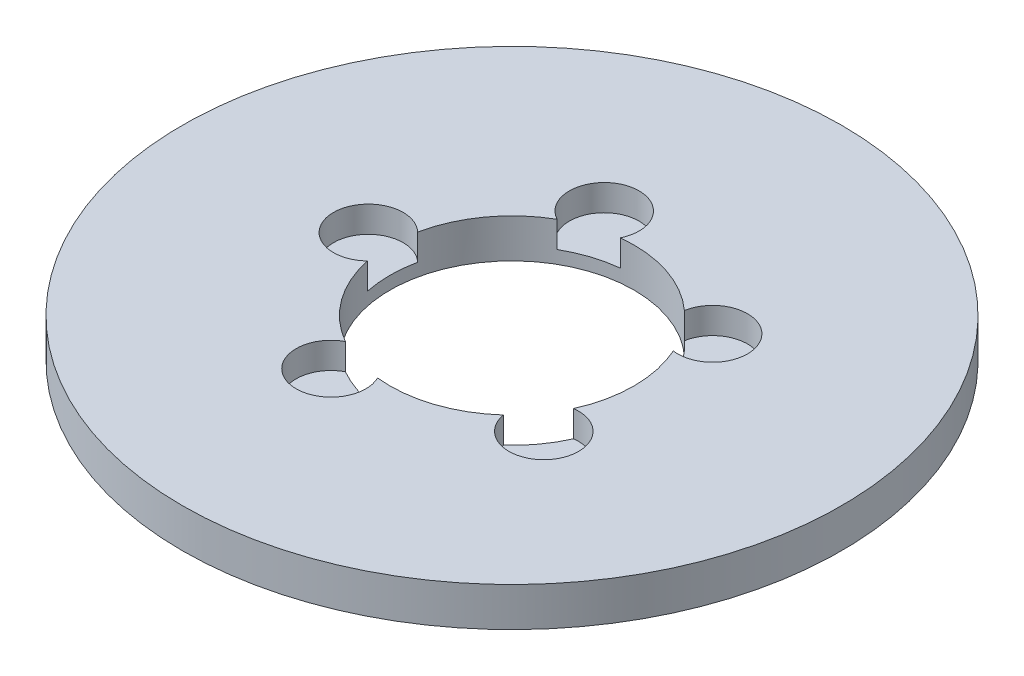
ISO-10303-21;
HEADER;
FILE_DESCRIPTION(('STEP AP214'),'2;1');
FILE_NAME('part.step','',(''),(''),'','','');
FILE_SCHEMA(('AUTOMOTIVE_DESIGN { 1 0 10303 214 1 1 1 1 }'));
ENDSEC;
DATA;
#1=APPLICATION_CONTEXT('core data for automotive mechanical design processes');
#2=APPLICATION_PROTOCOL_DEFINITION('international standard','automotive_design',2000,#1);
#3=PRODUCT_CONTEXT('',#1,'mechanical');
#4=PRODUCT('Part','Part','',(#3));
#5=PRODUCT_RELATED_PRODUCT_CATEGORY('part','',(#4));
#6=PRODUCT_DEFINITION_FORMATION('','',#4);
#7=PRODUCT_DEFINITION_CONTEXT('part definition',#1,'design');
#8=PRODUCT_DEFINITION('design','',#6,#7);
#9=PRODUCT_DEFINITION_SHAPE('','',#8);
#10=(LENGTH_UNIT() NAMED_UNIT(*) SI_UNIT(.MILLI.,.METRE.));
#11=(NAMED_UNIT(*) PLANE_ANGLE_UNIT() SI_UNIT($,.RADIAN.));
#12=(NAMED_UNIT(*) SI_UNIT($,.STERADIAN.) SOLID_ANGLE_UNIT());
#13=UNCERTAINTY_MEASURE_WITH_UNIT(LENGTH_MEASURE(1.E-05),#10,'distance_accuracy_value','');
#14=(GEOMETRIC_REPRESENTATION_CONTEXT(3) GLOBAL_UNCERTAINTY_ASSIGNED_CONTEXT((#13)) GLOBAL_UNIT_ASSIGNED_CONTEXT((#10,
#11,#12)) REPRESENTATION_CONTEXT('',''));
#15=CARTESIAN_POINT('',(0.,0.,0.));
#16=DIRECTION('',(0.,0.,1.));
#17=DIRECTION('',(1.,0.,0.));
#18=AXIS2_PLACEMENT_3D('',#15,#16,#17);
#19=CARTESIAN_POINT('',(0.,8.,0.));
#20=DIRECTION('',(0.,-1.,0.));
#21=DIRECTION('',(0.,0.,-1.));
#22=AXIS2_PLACEMENT_3D('',#19,#20,#21);
#23=CYLINDRICAL_SURFACE('',#22,67.5);
#24=CARTESIAN_POINT('',(0.,8.,0.));
#25=DIRECTION('',(0.,1.,0.));
#26=DIRECTION('',(0.,0.,1.));
#27=AXIS2_PLACEMENT_3D('',#24,#25,#26);
#28=CIRCLE('',#27,67.5);
#29=CARTESIAN_POINT('',(0.,8.,67.5));
#30=VERTEX_POINT('',#29);
#31=EDGE_CURVE('E157',#30,#30,#28,.T.);
#32=ORIENTED_EDGE('',*,*,#31,.F.);
#33=EDGE_LOOP('',(#32));
#34=FACE_BOUND('',#33,.T.);
#35=CARTESIAN_POINT('',(0.,0.,0.));
#36=DIRECTION('',(0.,1.,0.));
#37=DIRECTION('',(0.,0.,1.));
#38=AXIS2_PLACEMENT_3D('',#35,#36,#37);
#39=CIRCLE('',#38,67.5);
#40=CARTESIAN_POINT('',(0.,0.,67.5));
#41=VERTEX_POINT('',#40);
#42=EDGE_CURVE('E150',#41,#41,#39,.T.);
#43=ORIENTED_EDGE('',*,*,#42,.T.);
#44=EDGE_LOOP('',(#43));
#45=FACE_BOUND('',#44,.T.);
#46=ADVANCED_FACE('F39',(#34,#45),#23,.T.);
#47=CARTESIAN_POINT('',(0.,8.,0.));
#48=DIRECTION('',(0.,1.,0.));
#49=DIRECTION('',(0.,0.,1.));
#50=AXIS2_PLACEMENT_3D('',#47,#48,#49);
#51=PLANE('',#50);
#52=CARTESIAN_POINT('',(-9.09192710031537,8.,-27.9820743578371));
#53=DIRECTION('',(0.,1.,0.));
#54=DIRECTION('',(-0.95105651629515,0.,0.309016994374958));
#55=AXIS2_PLACEMENT_3D('',#52,#53,#54);
#56=CIRCLE('',#55,7.13841758908259);
#57=CARTESIAN_POINT('',(-2.6741215231742,8.,-24.8565700385089));
#58=VERTEX_POINT('',#57);
#59=CARTESIAN_POINT('',(-12.4469155339392,8.,-21.6811967771842));
#60=VERTEX_POINT('',#59);
#61=EDGE_CURVE('E194',#58,#60,#56,.T.);
#62=ORIENTED_EDGE('',*,*,#61,.F.);
#63=CARTESIAN_POINT('',(0.,8.,0.));
#64=DIRECTION('',(0.,1.,0.));
#65=DIRECTION('',(0.,0.,1.));
#66=AXIS2_PLACEMENT_3D('',#63,#64,#65);
#67=CIRCLE('',#66,25.);
#68=CARTESIAN_POINT('',(16.7737350484818,8.,-18.5375783888655));
#69=VERTEX_POINT('',#68);
#70=EDGE_CURVE('E147',#69,#58,#67,.T.);
#71=ORIENTED_EDGE('',*,*,#70,.F.);
#72=CARTESIAN_POINT('',(23.8029741718609,8.,-17.2938730288705));
#73=DIRECTION('',(0.,1.,0.));
#74=DIRECTION('',(-0.58778525229248,0.,-0.809016994374942));
#75=AXIS2_PLACEMENT_3D('',#72,#73,#74);
#76=CIRCLE('',#75,7.13841758908259);
#77=CARTESIAN_POINT('',(22.8136539121861,8.,-10.2243432637503));
#78=VERTEX_POINT('',#77);
#79=EDGE_CURVE('E254',#78,#69,#76,.T.);
#80=ORIENTED_EDGE('',*,*,#79,.F.);
#81=CARTESIAN_POINT('',(22.8136539121863,8.,10.2243432637499));
#82=VERTEX_POINT('',#81);
#83=EDGE_CURVE('E144',#82,#78,#67,.T.);
#84=ORIENTED_EDGE('',*,*,#83,.F.);
#85=CARTESIAN_POINT('',(23.8029741718612,8.,17.2938730288701));
#86=DIRECTION('',(0.,1.,0.));
#87=DIRECTION('',(0.587785252292469,0.,-0.809016994374951));
#88=AXIS2_PLACEMENT_3D('',#85,#86,#87);
#89=CIRCLE('',#88,7.13841758908259);
#90=CARTESIAN_POINT('',(16.7737350484821,8.,18.5375783888652));
#91=VERTEX_POINT('',#90);
#92=EDGE_CURVE('E141',#91,#82,#89,.T.);
#93=ORIENTED_EDGE('',*,*,#92,.F.);
#94=CARTESIAN_POINT('',(-2.67412152317385,8.,24.8565700385089));
#95=VERTEX_POINT('',#94);
#96=EDGE_CURVE('E134',#95,#91,#67,.T.);
#97=ORIENTED_EDGE('',*,*,#96,.F.);
#98=CARTESIAN_POINT('',(-9.09192710031498,8.,27.9820743578372));
#99=DIRECTION('',(0.,1.,0.));
#100=DIRECTION('',(0.951056516295155,0.,0.309016994374945));
#101=AXIS2_PLACEMENT_3D('',#98,#99,#100);
#102=CIRCLE('',#101,7.13841758908259);
#103=CARTESIAN_POINT('',(-12.4469155339389,8.,21.6811967771844));
#104=VERTEX_POINT('',#103);
#105=EDGE_CURVE('E111',#104,#95,#102,.T.);
#106=ORIENTED_EDGE('',*,*,#105,.F.);
#107=CARTESIAN_POINT('',(-24.4663519035553,8.,5.13786186379071));
#108=VERTEX_POINT('',#107);
#109=EDGE_CURVE('E145',#108,#104,#67,.T.);
#110=ORIENTED_EDGE('',*,*,#109,.F.);
#111=CARTESIAN_POINT('',(-29.4220941430921,8.,0.));
#112=DIRECTION('',(0.,1.,0.));
#113=DIRECTION('',(0.,0.,1.));
#114=AXIS2_PLACEMENT_3D('',#111,#112,#113);
#115=CIRCLE('',#114,7.13841758908259);
#116=CARTESIAN_POINT('',(-24.4663519035553,8.,-5.13786186379071));
#117=VERTEX_POINT('',#116);
#118=EDGE_CURVE('E153',#117,#108,#115,.T.);
#119=ORIENTED_EDGE('',*,*,#118,.F.);
#120=EDGE_CURVE('E146',#60,#117,#67,.T.);
#121=ORIENTED_EDGE('',*,*,#120,.F.);
#122=EDGE_LOOP('',(#62,#71,#80,#84,#93,#97,#106,#110,#119,#121));
#123=FACE_BOUND('',#122,.T.);
#124=ORIENTED_EDGE('',*,*,#31,.T.);
#125=EDGE_LOOP('',(#124));
#126=FACE_BOUND('',#125,.T.);
#127=ADVANCED_FACE('F139',(#123,#126),#51,.T.);
#128=CARTESIAN_POINT('',(0.,0.,0.));
#129=DIRECTION('',(0.,1.,0.));
#130=DIRECTION('',(0.,0.,1.));
#131=AXIS2_PLACEMENT_3D('',#128,#129,#130);
#132=PLANE('',#131);
#133=CARTESIAN_POINT('',(0.,0.,0.));
#134=DIRECTION('',(0.,1.,0.));
#135=DIRECTION('',(0.,0.,1.));
#136=AXIS2_PLACEMENT_3D('',#133,#134,#135);
#137=CIRCLE('',#136,25.);
#138=CARTESIAN_POINT('',(0.,0.,25.));
#139=VERTEX_POINT('',#138);
#140=EDGE_CURVE('E154',#139,#139,#137,.T.);
#141=ORIENTED_EDGE('',*,*,#140,.T.);
#142=EDGE_LOOP('',(#141));
#143=FACE_BOUND('',#142,.T.);
#144=ORIENTED_EDGE('',*,*,#42,.F.);
#145=EDGE_LOOP('',(#144));
#146=FACE_BOUND('',#145,.T.);
#147=ADVANCED_FACE('F213',(#143,#146),#132,.F.);
#148=CARTESIAN_POINT('',(0.,8.,0.));
#149=DIRECTION('',(0.,-1.,0.));
#150=DIRECTION('',(0.,0.,-1.));
#151=AXIS2_PLACEMENT_3D('',#148,#149,#150);
#152=CYLINDRICAL_SURFACE('',#151,25.);
#153=DIRECTION('',(0.,1.,0.));
#154=VECTOR('',#153,1.);
#155=CARTESIAN_POINT('',(-2.67412152317419,5.31698554322973,-24.8565700385089));
#156=LINE('',#155,#154);
#157=CARTESIAN_POINT('',(-2.6741215231742,2.63397108645947,-24.8565700385089));
#158=VERTEX_POINT('',#157);
#159=EDGE_CURVE('E11',#158,#58,#156,.T.);
#160=ORIENTED_EDGE('',*,*,#159,.F.);
#161=CARTESIAN_POINT('',(0.,2.63397108645947,0.));
#162=DIRECTION('',(0.,1.,0.));
#163=DIRECTION('',(0.,0.,1.));
#164=AXIS2_PLACEMENT_3D('',#161,#162,#163);
#165=CIRCLE('',#164,25.);
#166=CARTESIAN_POINT('',(-12.4469155339392,2.63397108645947,-21.6811967771842));
#167=VERTEX_POINT('',#166);
#168=EDGE_CURVE('E189',#158,#167,#165,.T.);
#169=ORIENTED_EDGE('',*,*,#168,.T.);
#170=DIRECTION('',(0.,1.,0.));
#171=VECTOR('',#170,1.);
#172=CARTESIAN_POINT('',(-12.4469155339392,5.31698554322973,-21.6811967771842));
#173=LINE('',#172,#171);
#174=EDGE_CURVE('E46',#60,#167,#173,.F.);
#175=ORIENTED_EDGE('',*,*,#174,.F.);
#176=ORIENTED_EDGE('',*,*,#120,.T.);
#177=DIRECTION('',(0.,1.,0.));
#178=VECTOR('',#177,1.);
#179=CARTESIAN_POINT('',(-24.4663519035553,5.31698554322973,-5.13786186379072));
#180=LINE('',#179,#178);
#181=CARTESIAN_POINT('',(-24.4663519035553,2.63397108645947,-5.13786186379071));
#182=VERTEX_POINT('',#181);
#183=EDGE_CURVE('E168',#182,#117,#180,.T.);
#184=ORIENTED_EDGE('',*,*,#183,.F.);
#185=CARTESIAN_POINT('',(0.,2.63397108645947,0.));
#186=DIRECTION('',(0.,1.,0.));
#187=DIRECTION('',(0.,0.,1.));
#188=AXIS2_PLACEMENT_3D('',#185,#186,#187);
#189=CIRCLE('',#188,25.);
#190=CARTESIAN_POINT('',(-24.4663519035553,2.63397108645947,5.13786186379071));
#191=VERTEX_POINT('',#190);
#192=EDGE_CURVE('E165',#182,#191,#189,.T.);
#193=ORIENTED_EDGE('',*,*,#192,.T.);
#194=DIRECTION('',(0.,1.,0.));
#195=VECTOR('',#194,1.);
#196=CARTESIAN_POINT('',(-24.4663519035553,5.31698554322973,5.13786186379072));
#197=LINE('',#196,#195);
#198=EDGE_CURVE('E170',#108,#191,#197,.F.);
#199=ORIENTED_EDGE('',*,*,#198,.F.);
#200=ORIENTED_EDGE('',*,*,#109,.T.);
#201=DIRECTION('',(0.,1.,0.));
#202=VECTOR('',#201,1.);
#203=CARTESIAN_POINT('',(-12.4469155339389,5.31698554322973,21.6811967771844));
#204=LINE('',#203,#202);
#205=CARTESIAN_POINT('',(-12.4469155339389,2.63397108645947,21.6811967771844));
#206=VERTEX_POINT('',#205);
#207=EDGE_CURVE('E121',#206,#104,#204,.T.);
#208=ORIENTED_EDGE('',*,*,#207,.F.);
#209=CARTESIAN_POINT('',(0.,2.63397108645947,0.));
#210=DIRECTION('',(0.,1.,0.));
#211=DIRECTION('',(0.,0.,1.));
#212=AXIS2_PLACEMENT_3D('',#209,#210,#211);
#213=CIRCLE('',#212,25.);
#214=CARTESIAN_POINT('',(-2.67412152317385,2.63397108645947,24.8565700385089));
#215=VERTEX_POINT('',#214);
#216=EDGE_CURVE('E136',#206,#215,#213,.T.);
#217=ORIENTED_EDGE('',*,*,#216,.T.);
#218=DIRECTION('',(0.,1.,0.));
#219=VECTOR('',#218,1.);
#220=CARTESIAN_POINT('',(-2.67412152317384,5.31698554322973,24.8565700385089));
#221=LINE('',#220,#219);
#222=EDGE_CURVE('E117',#95,#215,#221,.F.);
#223=ORIENTED_EDGE('',*,*,#222,.F.);
#224=ORIENTED_EDGE('',*,*,#96,.T.);
#225=DIRECTION('',(0.,1.,0.));
#226=VECTOR('',#225,1.);
#227=CARTESIAN_POINT('',(16.7737350484821,5.31698554322973,18.5375783888652));
#228=LINE('',#227,#226);
#229=CARTESIAN_POINT('',(16.7737350484821,2.63397108645947,18.5375783888652));
#230=VERTEX_POINT('',#229);
#231=EDGE_CURVE('E182',#230,#91,#228,.T.);
#232=ORIENTED_EDGE('',*,*,#231,.F.);
#233=CARTESIAN_POINT('',(0.,2.63397108645947,0.));
#234=DIRECTION('',(0.,1.,0.));
#235=DIRECTION('',(0.,0.,1.));
#236=AXIS2_PLACEMENT_3D('',#233,#234,#235);
#237=CIRCLE('',#236,25.);
#238=CARTESIAN_POINT('',(22.8136539121863,2.63397108645947,10.2243432637499));
#239=VERTEX_POINT('',#238);
#240=EDGE_CURVE('E174',#230,#239,#237,.T.);
#241=ORIENTED_EDGE('',*,*,#240,.T.);
#242=DIRECTION('',(0.,1.,0.));
#243=VECTOR('',#242,1.);
#244=CARTESIAN_POINT('',(22.8136539121863,5.31698554322973,10.2243432637499));
#245=LINE('',#244,#243);
#246=EDGE_CURVE('E177',#82,#239,#245,.F.);
#247=ORIENTED_EDGE('',*,*,#246,.F.);
#248=ORIENTED_EDGE('',*,*,#83,.T.);
#249=DIRECTION('',(0.,1.,0.));
#250=VECTOR('',#249,1.);
#251=CARTESIAN_POINT('',(22.8136539121861,5.31698554322973,-10.2243432637503));
#252=LINE('',#251,#250);
#253=CARTESIAN_POINT('',(22.8136539121861,2.63397108645947,-10.2243432637503));
#254=VERTEX_POINT('',#253);
#255=EDGE_CURVE('E187',#254,#78,#252,.T.);
#256=ORIENTED_EDGE('',*,*,#255,.F.);
#257=CARTESIAN_POINT('',(0.,2.63397108645947,0.));
#258=DIRECTION('',(0.,1.,0.));
#259=DIRECTION('',(0.,0.,1.));
#260=AXIS2_PLACEMENT_3D('',#257,#258,#259);
#261=CIRCLE('',#260,25.);
#262=CARTESIAN_POINT('',(16.7737350484818,2.63397108645947,-18.5375783888655));
#263=VERTEX_POINT('',#262);
#264=EDGE_CURVE('E181',#254,#263,#261,.T.);
#265=ORIENTED_EDGE('',*,*,#264,.T.);
#266=DIRECTION('',(0.,1.,0.));
#267=VECTOR('',#266,1.);
#268=CARTESIAN_POINT('',(16.7737350484818,5.31698554322973,-18.5375783888655));
#269=LINE('',#268,#267);
#270=EDGE_CURVE('E186',#69,#263,#269,.F.);
#271=ORIENTED_EDGE('',*,*,#270,.F.);
#272=ORIENTED_EDGE('',*,*,#70,.T.);
#273=EDGE_LOOP('',(#160,#169,#175,#176,#184,#193,#199,#200,#208,#217,#223,#224,#232,#241,#247,
#248,#256,#265,#271,#272));
#274=FACE_BOUND('',#273,.T.);
#275=ORIENTED_EDGE('',*,*,#140,.F.);
#276=EDGE_LOOP('',(#275));
#277=FACE_BOUND('',#276,.T.);
#278=ADVANCED_FACE('F135',(#274,#277),#152,.F.);
#279=CARTESIAN_POINT('',(-29.4220941430921,2.63397108645947,0.));
#280=DIRECTION('',(0.,1.,0.));
#281=DIRECTION('',(0.,0.,1.));
#282=AXIS2_PLACEMENT_3D('',#279,#280,#281);
#283=CYLINDRICAL_SURFACE('',#282,7.13841758908259);
#284=ORIENTED_EDGE('',*,*,#183,.T.);
#285=ORIENTED_EDGE('',*,*,#118,.T.);
#286=ORIENTED_EDGE('',*,*,#198,.T.);
#287=CARTESIAN_POINT('',(-29.4220941430921,2.63397108645947,0.));
#288=DIRECTION('',(0.,1.,0.));
#289=DIRECTION('',(0.,0.,1.));
#290=AXIS2_PLACEMENT_3D('',#287,#288,#289);
#291=CIRCLE('',#290,7.13841758908259);
#292=EDGE_CURVE('E158',#182,#191,#291,.T.);
#293=ORIENTED_EDGE('',*,*,#292,.F.);
#294=EDGE_LOOP('',(#284,#285,#286,#293));
#295=FACE_BOUND('',#294,.T.);
#296=ADVANCED_FACE('F221',(#295),#283,.F.);
#297=CARTESIAN_POINT('',(-29.4220941430921,2.63397108645947,0.));
#298=DIRECTION('',(0.,1.,0.));
#299=DIRECTION('',(0.,0.,1.));
#300=AXIS2_PLACEMENT_3D('',#297,#298,#299);
#301=PLANE('',#300);
#302=ORIENTED_EDGE('',*,*,#292,.T.);
#303=ORIENTED_EDGE('',*,*,#192,.F.);
#304=EDGE_LOOP('',(#302,#303));
#305=FACE_BOUND('',#304,.T.);
#306=ADVANCED_FACE('F227',(#305),#301,.T.);
#307=CARTESIAN_POINT('',(-9.09192710031498,2.63397108645947,27.9820743578372));
#308=DIRECTION('',(0.,1.,0.));
#309=DIRECTION('',(0.,0.,1.));
#310=AXIS2_PLACEMENT_3D('',#307,#308,#309);
#311=CYLINDRICAL_SURFACE('',#310,7.13841758908259);
#312=ORIENTED_EDGE('',*,*,#207,.T.);
#313=ORIENTED_EDGE('',*,*,#105,.T.);
#314=ORIENTED_EDGE('',*,*,#222,.T.);
#315=CARTESIAN_POINT('',(-9.09192710031498,2.63397108645947,27.9820743578372));
#316=DIRECTION('',(0.,1.,0.));
#317=DIRECTION('',(0.951056516295155,0.,0.309016994374945));
#318=AXIS2_PLACEMENT_3D('',#315,#316,#317);
#319=CIRCLE('',#318,7.13841758908259);
#320=EDGE_CURVE('E127',#206,#215,#319,.T.);
#321=ORIENTED_EDGE('',*,*,#320,.F.);
#322=EDGE_LOOP('',(#312,#313,#314,#321));
#323=FACE_BOUND('',#322,.T.);
#324=ADVANCED_FACE('F116',(#323),#311,.F.);
#325=CARTESIAN_POINT('',(-9.09192710031498,2.63397108645947,27.9820743578372));
#326=DIRECTION('',(0.,1.,0.));
#327=DIRECTION('',(0.951056516295155,0.,0.309016994374945));
#328=AXIS2_PLACEMENT_3D('',#325,#326,#327);
#329=PLANE('',#328);
#330=ORIENTED_EDGE('',*,*,#320,.T.);
#331=ORIENTED_EDGE('',*,*,#216,.F.);
#332=EDGE_LOOP('',(#330,#331));
#333=FACE_BOUND('',#332,.T.);
#334=ADVANCED_FACE('F234',(#333),#329,.T.);
#335=CARTESIAN_POINT('',(23.8029741718612,2.63397108645947,17.2938730288701));
#336=DIRECTION('',(0.,1.,0.));
#337=DIRECTION('',(0.,0.,1.));
#338=AXIS2_PLACEMENT_3D('',#335,#336,#337);
#339=CYLINDRICAL_SURFACE('',#338,7.13841758908259);
#340=ORIENTED_EDGE('',*,*,#231,.T.);
#341=ORIENTED_EDGE('',*,*,#92,.T.);
#342=ORIENTED_EDGE('',*,*,#246,.T.);
#343=CARTESIAN_POINT('',(23.8029741718612,2.63397108645947,17.2938730288701));
#344=DIRECTION('',(0.,1.,0.));
#345=DIRECTION('',(0.587785252292469,0.,-0.809016994374951));
#346=AXIS2_PLACEMENT_3D('',#343,#344,#345);
#347=CIRCLE('',#346,7.13841758908259);
#348=EDGE_CURVE('E130',#230,#239,#347,.T.);
#349=ORIENTED_EDGE('',*,*,#348,.F.);
#350=EDGE_LOOP('',(#340,#341,#342,#349));
#351=FACE_BOUND('',#350,.T.);
#352=ADVANCED_FACE('F240',(#351),#339,.F.);
#353=CARTESIAN_POINT('',(23.8029741718612,2.63397108645947,17.2938730288701));
#354=DIRECTION('',(0.,1.,0.));
#355=DIRECTION('',(0.587785252292469,0.,-0.809016994374951));
#356=AXIS2_PLACEMENT_3D('',#353,#354,#355);
#357=PLANE('',#356);
#358=ORIENTED_EDGE('',*,*,#348,.T.);
#359=ORIENTED_EDGE('',*,*,#240,.F.);
#360=EDGE_LOOP('',(#358,#359));
#361=FACE_BOUND('',#360,.T.);
#362=ADVANCED_FACE('F245',(#361),#357,.T.);
#363=CARTESIAN_POINT('',(23.8029741718609,2.63397108645947,-17.2938730288705));
#364=DIRECTION('',(0.,1.,0.));
#365=DIRECTION('',(0.,0.,1.));
#366=AXIS2_PLACEMENT_3D('',#363,#364,#365);
#367=CYLINDRICAL_SURFACE('',#366,7.13841758908259);
#368=ORIENTED_EDGE('',*,*,#255,.T.);
#369=ORIENTED_EDGE('',*,*,#79,.T.);
#370=ORIENTED_EDGE('',*,*,#270,.T.);
#371=CARTESIAN_POINT('',(23.8029741718609,2.63397108645947,-17.2938730288705));
#372=DIRECTION('',(0.,1.,0.));
#373=DIRECTION('',(-0.58778525229248,0.,-0.809016994374942));
#374=AXIS2_PLACEMENT_3D('',#371,#372,#373);
#375=CIRCLE('',#374,7.13841758908259);
#376=EDGE_CURVE('E56',#254,#263,#375,.T.);
#377=ORIENTED_EDGE('',*,*,#376,.F.);
#378=EDGE_LOOP('',(#368,#369,#370,#377));
#379=FACE_BOUND('',#378,.T.);
#380=ADVANCED_FACE('F266',(#379),#367,.F.);
#381=CARTESIAN_POINT('',(23.8029741718609,2.63397108645947,-17.2938730288705));
#382=DIRECTION('',(0.,1.,0.));
#383=DIRECTION('',(-0.58778525229248,0.,-0.809016994374942));
#384=AXIS2_PLACEMENT_3D('',#381,#382,#383);
#385=PLANE('',#384);
#386=ORIENTED_EDGE('',*,*,#376,.T.);
#387=ORIENTED_EDGE('',*,*,#264,.F.);
#388=EDGE_LOOP('',(#386,#387));
#389=FACE_BOUND('',#388,.T.);
#390=ADVANCED_FACE('F204',(#389),#385,.T.);
#391=CARTESIAN_POINT('',(-9.09192710031537,2.63397108645947,-27.9820743578371));
#392=DIRECTION('',(0.,1.,0.));
#393=DIRECTION('',(0.,0.,1.));
#394=AXIS2_PLACEMENT_3D('',#391,#392,#393);
#395=CYLINDRICAL_SURFACE('',#394,7.13841758908259);
#396=ORIENTED_EDGE('',*,*,#159,.T.);
#397=ORIENTED_EDGE('',*,*,#61,.T.);
#398=ORIENTED_EDGE('',*,*,#174,.T.);
#399=CARTESIAN_POINT('',(-9.09192710031537,2.63397108645947,-27.9820743578371));
#400=DIRECTION('',(0.,1.,0.));
#401=DIRECTION('',(-0.95105651629515,0.,0.309016994374958));
#402=AXIS2_PLACEMENT_3D('',#399,#400,#401);
#403=CIRCLE('',#402,7.13841758908259);
#404=EDGE_CURVE('E55',#158,#167,#403,.T.);
#405=ORIENTED_EDGE('',*,*,#404,.F.);
#406=EDGE_LOOP('',(#396,#397,#398,#405));
#407=FACE_BOUND('',#406,.T.);
#408=ADVANCED_FACE('F193',(#407),#395,.F.);
#409=CARTESIAN_POINT('',(-9.09192710031537,2.63397108645947,-27.9820743578371));
#410=DIRECTION('',(0.,1.,0.));
#411=DIRECTION('',(-0.95105651629515,0.,0.309016994374958));
#412=AXIS2_PLACEMENT_3D('',#409,#410,#411);
#413=PLANE('',#412);
#414=ORIENTED_EDGE('',*,*,#404,.T.);
#415=ORIENTED_EDGE('',*,*,#168,.F.);
#416=EDGE_LOOP('',(#414,#415));
#417=FACE_BOUND('',#416,.T.);
#418=ADVANCED_FACE('F196',(#417),#413,.T.);
#419=CLOSED_SHELL('',(#46,#127,#147,#278,#296,#306,#324,#334,#352,#362,#380,#390,#408,#418));
#420=MANIFOLD_SOLID_BREP('B2',#419);
#421=ADVANCED_BREP_SHAPE_REPRESENTATION('',(#18,#420),#14);
#422=SHAPE_DEFINITION_REPRESENTATION(#9,#421);
ENDSEC;
END-ISO-10303-21;
